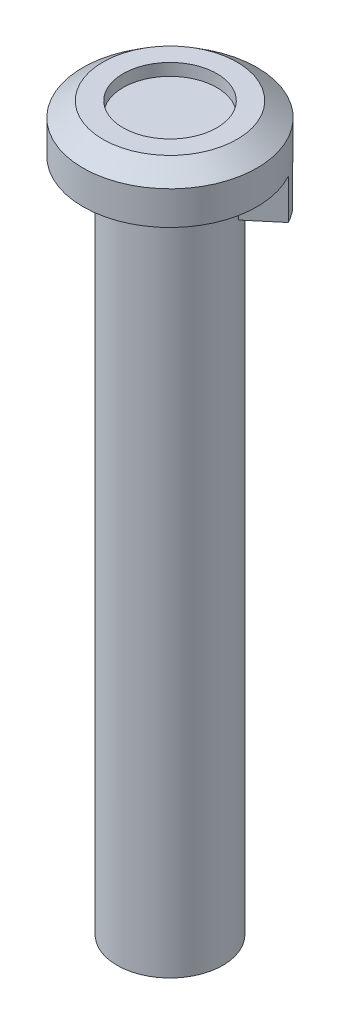
ISO-10303-21;
HEADER;
FILE_DESCRIPTION(('STEP AP214'),'2;1');
FILE_NAME('part.step','',(''),(''),'','','');
FILE_SCHEMA(('AUTOMOTIVE_DESIGN { 1 0 10303 214 1 1 1 1 }'));
ENDSEC;
DATA;
#1=APPLICATION_CONTEXT('core data for automotive mechanical design processes');
#2=APPLICATION_PROTOCOL_DEFINITION('international standard','automotive_design',2000,#1);
#3=PRODUCT_CONTEXT('',#1,'mechanical');
#4=PRODUCT('Part','Part','',(#3));
#5=PRODUCT_RELATED_PRODUCT_CATEGORY('part','',(#4));
#6=PRODUCT_DEFINITION_FORMATION('','',#4);
#7=PRODUCT_DEFINITION_CONTEXT('part definition',#1,'design');
#8=PRODUCT_DEFINITION('design','',#6,#7);
#9=PRODUCT_DEFINITION_SHAPE('','',#8);
#10=(LENGTH_UNIT() NAMED_UNIT(*) SI_UNIT(.MILLI.,.METRE.));
#11=(NAMED_UNIT(*) PLANE_ANGLE_UNIT() SI_UNIT($,.RADIAN.));
#12=(NAMED_UNIT(*) SI_UNIT($,.STERADIAN.) SOLID_ANGLE_UNIT());
#13=UNCERTAINTY_MEASURE_WITH_UNIT(LENGTH_MEASURE(1.E-05),#10,'distance_accuracy_value','');
#14=(GEOMETRIC_REPRESENTATION_CONTEXT(3) GLOBAL_UNCERTAINTY_ASSIGNED_CONTEXT((#13)) GLOBAL_UNIT_ASSIGNED_CONTEXT((#10,
#11,#12)) REPRESENTATION_CONTEXT('',''));
#15=CARTESIAN_POINT('',(0.,0.,0.));
#16=DIRECTION('',(0.,0.,1.));
#17=DIRECTION('',(1.,0.,0.));
#18=AXIS2_PLACEMENT_3D('',#15,#16,#17);
#19=CARTESIAN_POINT('',(-0.803484512108176,0.,-0.957555553898722));
#20=DIRECTION('',(-0.642787609686541,0.,-0.766044443118977));
#21=DIRECTION('',(-0.766044443118977,0.,0.64278760968654));
#22=AXIS2_PLACEMENT_3D('',#19,#20,#21);
#23=PLANE('',#22);
#24=DIRECTION('',(-0.766044443118977,0.,0.64278760968654));
#25=VECTOR('',#24,1.);
#26=CARTESIAN_POINT('',(-0.803484512108176,0.,-0.957555553898722));
#27=LINE('',#26,#25);
#28=CARTESIAN_POINT('',(4.08286434101432,0.,-5.05768907435735));
#29=VERTEX_POINT('',#28);
#30=CARTESIAN_POINT('',(2.06688309626916,0.,-3.36607995543136));
#31=VERTEX_POINT('',#30);
#32=EDGE_CURVE('E113',#29,#31,#27,.T.);
#33=ORIENTED_EDGE('',*,*,#32,.F.);
#34=DIRECTION('',(0.,1.,0.));
#35=VECTOR('',#34,1.);
#36=CARTESIAN_POINT('',(4.08286434101432,-50.3,-5.05768907435735));
#37=LINE('',#36,#35);
#38=CARTESIAN_POINT('',(4.08286434101432,-0.12132458891346,-5.05768907435735));
#39=VERTEX_POINT('',#38);
#40=EDGE_CURVE('E101',#29,#39,#37,.F.);
#41=ORIENTED_EDGE('',*,*,#40,.T.);
#42=DIRECTION('',(0.541675220419704,0.707106781186544,-0.454519477672047));
#43=VECTOR('',#42,1.);
#44=CARTESIAN_POINT('',(4.17580436816517,0.,-5.13567501686123));
#45=LINE('',#44,#43);
#46=CARTESIAN_POINT('',(2.06688309626916,-2.75300120096093,-3.36607995543137));
#47=VERTEX_POINT('',#46);
#48=EDGE_CURVE('E108',#47,#39,#45,.T.);
#49=ORIENTED_EDGE('',*,*,#48,.F.);
#50=DIRECTION('',(0.,1.,0.));
#51=VECTOR('',#50,1.);
#52=CARTESIAN_POINT('',(2.06688309626916,6.295,-3.36607995543137));
#53=LINE('',#52,#51);
#54=EDGE_CURVE('E120',#31,#47,#53,.F.);
#55=ORIENTED_EDGE('',*,*,#54,.F.);
#56=EDGE_LOOP('',(#33,#41,#49,#55));
#57=FACE_BOUND('',#56,.T.);
#58=ADVANCED_FACE('F40',(#57),#23,.T.);
#59=CARTESIAN_POINT('',(4.17580436816517,0.,-5.13567501686123));
#60=DIRECTION('',(0.541675220419698,-0.707106781186551,-0.454519477672042));
#61=DIRECTION('',(0.793844806099449,0.608120402411338,0.));
#62=AXIS2_PLACEMENT_3D('',#59,#60,#61);
#63=PLANE('',#62);
#64=ORIENTED_EDGE('',*,*,#48,.T.);
#65=CARTESIAN_POINT('',(0.,-6.49999999999994,0.));
#66=DIRECTION('',(0.541675220419698,-0.707106781186551,-0.454519477672042));
#67=DIRECTION('',(0.541675220419704,0.707106781186544,-0.454519477672047));
#68=AXIS2_PLACEMENT_3D('',#65,#66,#67);
#69=ELLIPSE('',#68,9.19238815542507,6.5);
#70=CARTESIAN_POINT('',(4.97928888027335,0.,-4.17811946296251));
#71=VERTEX_POINT('',#70);
#72=EDGE_CURVE('E92',#39,#71,#69,.T.);
#73=ORIENTED_EDGE('',*,*,#72,.T.);
#74=DIRECTION('',(0.541675220419704,0.707106781186544,-0.454519477672047));
#75=VECTOR('',#74,1.);
#76=CARTESIAN_POINT('',(4.97928888027335,0.,-4.17811946296251));
#77=LINE('',#76,#75);
#78=CARTESIAN_POINT('',(3.02587555031996,-2.54999999999997,-2.53901105826184));
#79=VERTEX_POINT('',#78);
#80=EDGE_CURVE('E106',#79,#71,#77,.T.);
#81=ORIENTED_EDGE('',*,*,#80,.F.);
#82=CARTESIAN_POINT('',(0.,-6.49999999999993,0.));
#83=DIRECTION('',(0.541675220419698,-0.707106781186551,-0.454519477672042));
#84=DIRECTION('',(0.541675220419704,0.707106781186544,-0.454519477672047));
#85=AXIS2_PLACEMENT_3D('',#82,#83,#84);
#86=ELLIPSE('',#85,5.5861435713737,3.95);
#87=EDGE_CURVE('E118',#47,#79,#86,.T.);
#88=ORIENTED_EDGE('',*,*,#87,.F.);
#89=EDGE_LOOP('',(#64,#73,#81,#88));
#90=FACE_BOUND('',#89,.T.);
#91=ADVANCED_FACE('F105',(#90),#63,.T.);
#92=CARTESIAN_POINT('',(5.78277339238152,-3.,-3.22056390906379));
#93=DIRECTION('',(0.,1.,0.));
#94=DIRECTION('',(-1.,0.,0.));
#95=AXIS2_PLACEMENT_3D('',#92,#93,#94);
#96=PLANE('',#95);
#97=CARTESIAN_POINT('',(0.,-3.,0.));
#98=DIRECTION('',(0.,1.,0.));
#99=DIRECTION('',(-1.,0.,0.));
#100=AXIS2_PLACEMENT_3D('',#97,#98,#99);
#101=CIRCLE('',#100,6.5);
#102=CARTESIAN_POINT('',(5.68983336523067,-3.,-3.14257796655991));
#103=VERTEX_POINT('',#102);
#104=CARTESIAN_POINT('',(4.97928888027335,-3.,-4.17811946296251));
#105=VERTEX_POINT('',#104);
#106=EDGE_CURVE('E95',#103,#105,#101,.T.);
#107=ORIENTED_EDGE('',*,*,#106,.F.);
#108=DIRECTION('',(0.766044443118977,0.,-0.642787609686541));
#109=VECTOR('',#108,1.);
#110=CARTESIAN_POINT('',(5.78277339238152,-3.,-3.22056390906379));
#111=LINE('',#110,#109);
#112=CARTESIAN_POINT('',(3.67385212048552,-3.,-1.45096884763392));
#113=VERTEX_POINT('',#112);
#114=EDGE_CURVE('E155',#113,#103,#111,.T.);
#115=ORIENTED_EDGE('',*,*,#114,.F.);
#116=CARTESIAN_POINT('',(0.,-3.,0.));
#117=DIRECTION('',(0.,1.,0.));
#118=DIRECTION('',(-1.,0.,0.));
#119=AXIS2_PLACEMENT_3D('',#116,#117,#118);
#120=CIRCLE('',#119,3.95);
#121=CARTESIAN_POINT('',(3.02587555031996,-3.,-2.53901105826184));
#122=VERTEX_POINT('',#121);
#123=EDGE_CURVE('E12',#113,#122,#120,.T.);
#124=ORIENTED_EDGE('',*,*,#123,.T.);
#125=DIRECTION('',(0.766044443118977,0.,-0.642787609686541));
#126=VECTOR('',#125,1.);
#127=CARTESIAN_POINT('',(4.97928888027335,-3.,-4.17811946296251));
#128=LINE('',#127,#126);
#129=EDGE_CURVE('E100',#122,#105,#128,.T.);
#130=ORIENTED_EDGE('',*,*,#129,.T.);
#131=EDGE_LOOP('',(#107,#115,#124,#130));
#132=FACE_BOUND('',#131,.T.);
#133=ADVANCED_FACE('F164',(#132),#96,.F.);
#134=CARTESIAN_POINT('',(0.803484512108176,0.,0.957555553898722));
#135=DIRECTION('',(-0.642787609686541,0.,-0.766044443118977));
#136=DIRECTION('',(-0.766044443118977,0.,0.642787609686541));
#137=AXIS2_PLACEMENT_3D('',#134,#135,#136);
#138=PLANE('',#137);
#139=DIRECTION('',(0.,1.,0.));
#140=VECTOR('',#139,1.);
#141=CARTESIAN_POINT('',(5.68983336523067,-50.3,-3.14257796655991));
#142=LINE('',#141,#140);
#143=CARTESIAN_POINT('',(5.68983336523068,0.,-3.14257796655991));
#144=VERTEX_POINT('',#143);
#145=EDGE_CURVE('E154',#144,#103,#142,.F.);
#146=ORIENTED_EDGE('',*,*,#145,.F.);
#147=DIRECTION('',(-0.766044443118977,0.,0.64278760968654));
#148=VECTOR('',#147,1.);
#149=CARTESIAN_POINT('',(5.78277339238153,0.,-3.22056390906379));
#150=LINE('',#149,#148);
#151=CARTESIAN_POINT('',(3.67385212048551,0.,-1.45096884763392));
#152=VERTEX_POINT('',#151);
#153=EDGE_CURVE('E148',#144,#152,#150,.T.);
#154=ORIENTED_EDGE('',*,*,#153,.T.);
#155=DIRECTION('',(0.,1.,0.));
#156=VECTOR('',#155,1.);
#157=CARTESIAN_POINT('',(3.67385212048552,6.295,-1.45096884763392));
#158=LINE('',#157,#156);
#159=EDGE_CURVE('E111',#152,#113,#158,.F.);
#160=ORIENTED_EDGE('',*,*,#159,.T.);
#161=ORIENTED_EDGE('',*,*,#114,.T.);
#162=EDGE_LOOP('',(#146,#154,#160,#161));
#163=FACE_BOUND('',#162,.T.);
#164=ADVANCED_FACE('F151',(#163),#138,.F.);
#165=CARTESIAN_POINT('',(0.,6.295,0.));
#166=DIRECTION('',(0.,1.,0.));
#167=DIRECTION('',(0.,0.,1.));
#168=AXIS2_PLACEMENT_3D('',#165,#166,#167);
#169=CYLINDRICAL_SURFACE('',#168,3.95);
#170=CARTESIAN_POINT('',(0.,-50.3,0.));
#171=DIRECTION('',(0.,1.,0.));
#172=DIRECTION('',(0.,0.,1.));
#173=AXIS2_PLACEMENT_3D('',#170,#171,#172);
#174=CIRCLE('',#173,3.95000000000001);
#175=CARTESIAN_POINT('',(0.,-50.3,3.95000000000001));
#176=VERTEX_POINT('',#175);
#177=EDGE_CURVE('E138',#176,#176,#174,.T.);
#178=ORIENTED_EDGE('',*,*,#177,.T.);
#179=EDGE_LOOP('',(#178));
#180=FACE_BOUND('',#179,.T.);
#181=ORIENTED_EDGE('',*,*,#159,.F.);
#182=CARTESIAN_POINT('',(0.,0.,0.));
#183=DIRECTION('',(0.,1.,0.));
#184=DIRECTION('',(0.,0.,1.));
#185=AXIS2_PLACEMENT_3D('',#182,#183,#184);
#186=CIRCLE('',#185,3.95);
#187=EDGE_CURVE('E48',#31,#152,#186,.T.);
#188=ORIENTED_EDGE('',*,*,#187,.F.);
#189=ORIENTED_EDGE('',*,*,#54,.T.);
#190=ORIENTED_EDGE('',*,*,#87,.T.);
#191=DIRECTION('',(0.,1.,0.));
#192=VECTOR('',#191,1.);
#193=CARTESIAN_POINT('',(3.02587555031996,6.295,-2.53901105826184));
#194=LINE('',#193,#192);
#195=EDGE_CURVE('E58',#79,#122,#194,.F.);
#196=ORIENTED_EDGE('',*,*,#195,.T.);
#197=ORIENTED_EDGE('',*,*,#123,.F.);
#198=EDGE_LOOP('',(#181,#188,#189,#190,#196,#197));
#199=FACE_BOUND('',#198,.T.);
#200=ADVANCED_FACE('F42',(#180,#199),#169,.T.);
#201=CARTESIAN_POINT('',(0.,0.,0.));
#202=DIRECTION('',(0.,1.,0.));
#203=DIRECTION('',(0.,0.,1.));
#204=AXIS2_PLACEMENT_3D('',#201,#202,#203);
#205=PLANE('',#204);
#206=ORIENTED_EDGE('',*,*,#153,.F.);
#207=CARTESIAN_POINT('',(0.,0.,0.));
#208=DIRECTION('',(0.,1.,0.));
#209=DIRECTION('',(0.,0.,1.));
#210=AXIS2_PLACEMENT_3D('',#207,#208,#209);
#211=CIRCLE('',#210,6.5);
#212=EDGE_CURVE('E135',#29,#144,#211,.T.);
#213=ORIENTED_EDGE('',*,*,#212,.F.);
#214=ORIENTED_EDGE('',*,*,#32,.T.);
#215=ORIENTED_EDGE('',*,*,#187,.T.);
#216=EDGE_LOOP('',(#206,#213,#214,#215));
#217=FACE_BOUND('',#216,.T.);
#218=ADVANCED_FACE('F146',(#217),#205,.F.);
#219=CARTESIAN_POINT('',(3.95000000000001,-50.3,0.));
#220=DIRECTION('',(0.,1.,0.));
#221=DIRECTION('',(0.,0.,1.));
#222=AXIS2_PLACEMENT_3D('',#219,#220,#221);
#223=PLANE('',#222);
#224=ORIENTED_EDGE('',*,*,#177,.F.);
#225=EDGE_LOOP('',(#224));
#226=FACE_BOUND('',#225,.T.);
#227=ADVANCED_FACE('F198',(#226),#223,.F.);
#228=CARTESIAN_POINT('',(0.,6.295,0.));
#229=DIRECTION('',(0.,1.,0.));
#230=DIRECTION('',(0.,0.,1.));
#231=AXIS2_PLACEMENT_3D('',#228,#229,#230);
#232=CYLINDRICAL_SURFACE('',#231,6.5);
#233=CARTESIAN_POINT('',(0.,2.5,0.));
#234=DIRECTION('',(0.,1.,0.));
#235=DIRECTION('',(0.,0.,1.));
#236=AXIS2_PLACEMENT_3D('',#233,#234,#235);
#237=CIRCLE('',#236,6.5);
#238=CARTESIAN_POINT('',(0.,2.5,6.5));
#239=VERTEX_POINT('',#238);
#240=EDGE_CURVE('E132',#239,#239,#237,.T.);
#241=ORIENTED_EDGE('',*,*,#240,.F.);
#242=EDGE_LOOP('',(#241));
#243=FACE_BOUND('',#242,.T.);
#244=DIRECTION('',(0.,1.,0.));
#245=VECTOR('',#244,1.);
#246=CARTESIAN_POINT('',(4.97928888027335,0.,-4.17811946296251));
#247=LINE('',#246,#245);
#248=EDGE_CURVE('E89',#105,#71,#247,.T.);
#249=ORIENTED_EDGE('',*,*,#248,.T.);
#250=ORIENTED_EDGE('',*,*,#72,.F.);
#251=ORIENTED_EDGE('',*,*,#40,.F.);
#252=ORIENTED_EDGE('',*,*,#212,.T.);
#253=ORIENTED_EDGE('',*,*,#145,.T.);
#254=ORIENTED_EDGE('',*,*,#106,.T.);
#255=EDGE_LOOP('',(#249,#250,#251,#252,#253,#254));
#256=FACE_BOUND('',#255,.T.);
#257=ADVANCED_FACE('F91',(#243,#256),#232,.T.);
#258=CARTESIAN_POINT('',(0.,2.5,0.));
#259=DIRECTION('',(0.,-1.,0.));
#260=DIRECTION('',(0.,0.,-1.));
#261=AXIS2_PLACEMENT_3D('',#258,#259,#260);
#262=CONICAL_SURFACE('',#261,6.5,0.938047491792713);
#263=CARTESIAN_POINT('',(0.,3.6,0.));
#264=DIRECTION('',(0.,1.,0.));
#265=DIRECTION('',(0.,0.,1.));
#266=AXIS2_PLACEMENT_3D('',#263,#264,#265);
#267=CIRCLE('',#266,5.);
#268=CARTESIAN_POINT('',(0.,3.6,5.));
#269=VERTEX_POINT('',#268);
#270=EDGE_CURVE('E129',#269,#269,#267,.T.);
#271=ORIENTED_EDGE('',*,*,#270,.F.);
#272=EDGE_LOOP('',(#271));
#273=FACE_BOUND('',#272,.T.);
#274=ORIENTED_EDGE('',*,*,#240,.T.);
#275=EDGE_LOOP('',(#274));
#276=FACE_BOUND('',#275,.T.);
#277=ADVANCED_FACE('F191',(#273,#276),#262,.T.);
#278=CARTESIAN_POINT('',(5.,3.6,0.));
#279=DIRECTION('',(0.,-1.,0.));
#280=DIRECTION('',(0.,0.,-1.));
#281=AXIS2_PLACEMENT_3D('',#278,#279,#280);
#282=PLANE('',#281);
#283=CARTESIAN_POINT('',(0.,3.6,0.));
#284=DIRECTION('',(0.,1.,0.));
#285=DIRECTION('',(0.,0.,1.));
#286=AXIS2_PLACEMENT_3D('',#283,#284,#285);
#287=CIRCLE('',#286,3.5);
#288=CARTESIAN_POINT('',(0.,3.6,3.5));
#289=VERTEX_POINT('',#288);
#290=EDGE_CURVE('E126',#289,#289,#287,.T.);
#291=ORIENTED_EDGE('',*,*,#290,.F.);
#292=EDGE_LOOP('',(#291));
#293=FACE_BOUND('',#292,.T.);
#294=ORIENTED_EDGE('',*,*,#270,.T.);
#295=EDGE_LOOP('',(#294));
#296=FACE_BOUND('',#295,.T.);
#297=ADVANCED_FACE('F187',(#293,#296),#282,.F.);
#298=CARTESIAN_POINT('',(0.,6.295,0.));
#299=DIRECTION('',(0.,1.,0.));
#300=DIRECTION('',(0.,0.,1.));
#301=AXIS2_PLACEMENT_3D('',#298,#299,#300);
#302=CYLINDRICAL_SURFACE('',#301,3.5);
#303=CARTESIAN_POINT('',(0.,2.7,0.));
#304=DIRECTION('',(0.,1.,0.));
#305=DIRECTION('',(0.,0.,1.));
#306=AXIS2_PLACEMENT_3D('',#303,#304,#305);
#307=CIRCLE('',#306,3.5);
#308=CARTESIAN_POINT('',(0.,2.7,3.5));
#309=VERTEX_POINT('',#308);
#310=EDGE_CURVE('E123',#309,#309,#307,.T.);
#311=ORIENTED_EDGE('',*,*,#310,.F.);
#312=EDGE_LOOP('',(#311));
#313=FACE_BOUND('',#312,.T.);
#314=ORIENTED_EDGE('',*,*,#290,.T.);
#315=EDGE_LOOP('',(#314));
#316=FACE_BOUND('',#315,.T.);
#317=ADVANCED_FACE('F183',(#313,#316),#302,.F.);
#318=CARTESIAN_POINT('',(3.5,2.7,0.));
#319=DIRECTION('',(0.,-1.,0.));
#320=DIRECTION('',(0.,0.,-1.));
#321=AXIS2_PLACEMENT_3D('',#318,#319,#320);
#322=PLANE('',#321);
#323=ORIENTED_EDGE('',*,*,#310,.T.);
#324=EDGE_LOOP('',(#323));
#325=FACE_BOUND('',#324,.T.);
#326=ADVANCED_FACE('F180',(#325),#322,.F.);
#327=CARTESIAN_POINT('',(0.,0.,0.));
#328=DIRECTION('',(-0.642787609686541,0.,-0.766044443118977));
#329=DIRECTION('',(-0.766044443118977,0.,0.642787609686541));
#330=AXIS2_PLACEMENT_3D('',#327,#328,#329);
#331=PLANE('',#330);
#332=ORIENTED_EDGE('',*,*,#195,.F.);
#333=ORIENTED_EDGE('',*,*,#80,.T.);
#334=ORIENTED_EDGE('',*,*,#248,.F.);
#335=ORIENTED_EDGE('',*,*,#129,.F.);
#336=EDGE_LOOP('',(#332,#333,#334,#335));
#337=FACE_BOUND('',#336,.T.);
#338=ADVANCED_FACE('F110',(#337),#331,.T.);
#339=CLOSED_SHELL('',(#58,#91,#133,#164,#200,#218,#227,#257,#277,#297,#317,#326,#338));
#340=MANIFOLD_SOLID_BREP('B2',#339);
#341=ADVANCED_BREP_SHAPE_REPRESENTATION('',(#18,#340),#14);
#342=SHAPE_DEFINITION_REPRESENTATION(#9,#341);
ENDSEC;
END-ISO-10303-21;
